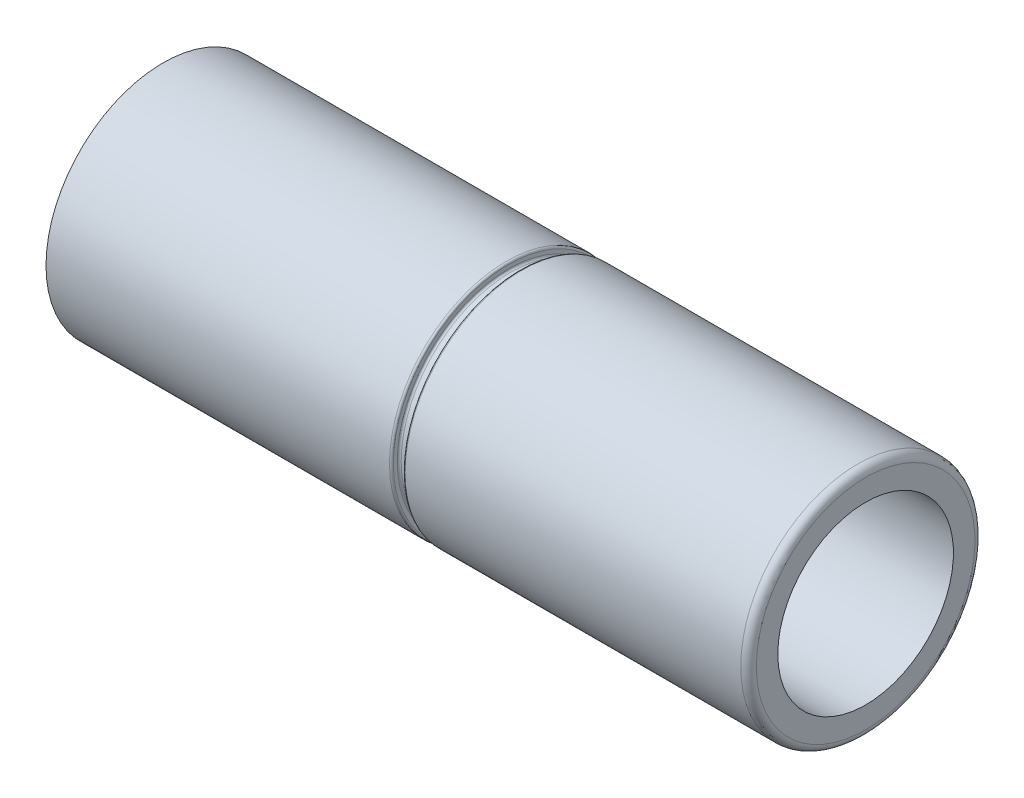
ISO-10303-21;
HEADER;
FILE_DESCRIPTION(('STEP AP214'),'2;1');
FILE_NAME('part.step','',(''),(''),'','','');
FILE_SCHEMA(('AUTOMOTIVE_DESIGN { 1 0 10303 214 1 1 1 1 }'));
ENDSEC;
DATA;
#1=APPLICATION_CONTEXT('core data for automotive mechanical design processes');
#2=APPLICATION_PROTOCOL_DEFINITION('international standard','automotive_design',2000,#1);
#3=PRODUCT_CONTEXT('',#1,'mechanical');
#4=PRODUCT('Part','Part','',(#3));
#5=PRODUCT_RELATED_PRODUCT_CATEGORY('part','',(#4));
#6=PRODUCT_DEFINITION_FORMATION('','',#4);
#7=PRODUCT_DEFINITION_CONTEXT('part definition',#1,'design');
#8=PRODUCT_DEFINITION('design','',#6,#7);
#9=PRODUCT_DEFINITION_SHAPE('','',#8);
#10=(LENGTH_UNIT() NAMED_UNIT(*) SI_UNIT(.MILLI.,.METRE.));
#11=(NAMED_UNIT(*) PLANE_ANGLE_UNIT() SI_UNIT($,.RADIAN.));
#12=(NAMED_UNIT(*) SI_UNIT($,.STERADIAN.) SOLID_ANGLE_UNIT());
#13=UNCERTAINTY_MEASURE_WITH_UNIT(LENGTH_MEASURE(1.E-05),#10,'distance_accuracy_value','');
#14=(GEOMETRIC_REPRESENTATION_CONTEXT(3) GLOBAL_UNCERTAINTY_ASSIGNED_CONTEXT((#13)) GLOBAL_UNIT_ASSIGNED_CONTEXT((#10,
#11,#12)) REPRESENTATION_CONTEXT('',''));
#15=CARTESIAN_POINT('',(0.,0.,0.));
#16=DIRECTION('',(0.,0.,1.));
#17=DIRECTION('',(1.,0.,0.));
#18=AXIS2_PLACEMENT_3D('',#15,#16,#17);
#19=CARTESIAN_POINT('',(0.,0.,0.));
#20=DIRECTION('',(-1.,0.,0.));
#21=DIRECTION('',(0.,0.,1.));
#22=AXIS2_PLACEMENT_3D('',#19,#20,#21);
#23=CYLINDRICAL_SURFACE('',#22,2.25);
#24=CARTESIAN_POINT('',(18.,0.,0.));
#25=DIRECTION('',(-1.,0.,0.));
#26=DIRECTION('',(0.,0.,1.));
#27=AXIS2_PLACEMENT_3D('',#24,#25,#26);
#28=CIRCLE('',#27,2.25);
#29=CARTESIAN_POINT('',(18.,0.,2.25));
#30=VERTEX_POINT('',#29);
#31=EDGE_CURVE('E45',#30,#30,#28,.T.);
#32=ORIENTED_EDGE('',*,*,#31,.F.);
#33=EDGE_LOOP('',(#32));
#34=FACE_BOUND('',#33,.T.);
#35=CARTESIAN_POINT('',(0.,0.,0.));
#36=DIRECTION('',(-1.,0.,0.));
#37=DIRECTION('',(0.,0.,1.));
#38=AXIS2_PLACEMENT_3D('',#35,#36,#37);
#39=CIRCLE('',#38,2.25);
#40=CARTESIAN_POINT('',(0.,0.,2.25));
#41=VERTEX_POINT('',#40);
#42=EDGE_CURVE('E78',#41,#41,#39,.T.);
#43=ORIENTED_EDGE('',*,*,#42,.T.);
#44=EDGE_LOOP('',(#43));
#45=FACE_BOUND('',#44,.T.);
#46=ADVANCED_FACE('F34',(#34,#45),#23,.F.);
#47=CARTESIAN_POINT('',(18.,0.,-2.25));
#48=DIRECTION('',(-1.,0.,0.));
#49=DIRECTION('',(0.,0.,1.));
#50=AXIS2_PLACEMENT_3D('',#47,#48,#49);
#51=PLANE('',#50);
#52=CARTESIAN_POINT('',(18.,0.,0.));
#53=DIRECTION('',(-1.,0.,0.));
#54=DIRECTION('',(0.,0.,1.));
#55=AXIS2_PLACEMENT_3D('',#52,#53,#54);
#56=CIRCLE('',#55,2.8);
#57=CARTESIAN_POINT('',(18.,0.,2.8));
#58=VERTEX_POINT('',#57);
#59=EDGE_CURVE('E10',#58,#58,#56,.F.);
#60=ORIENTED_EDGE('',*,*,#59,.T.);
#61=EDGE_LOOP('',(#60));
#62=FACE_BOUND('',#61,.T.);
#63=ORIENTED_EDGE('',*,*,#31,.T.);
#64=EDGE_LOOP('',(#63));
#65=FACE_BOUND('',#64,.T.);
#66=ADVANCED_FACE('F139',(#62,#65),#51,.F.);
#67=CARTESIAN_POINT('',(0.,0.,0.));
#68=DIRECTION('',(-1.,0.,0.));
#69=DIRECTION('',(0.,0.,1.));
#70=AXIS2_PLACEMENT_3D('',#67,#68,#69);
#71=CYLINDRICAL_SURFACE('',#70,3.);
#72=CARTESIAN_POINT('',(17.8,0.,0.));
#73=DIRECTION('',(-1.,0.,0.));
#74=DIRECTION('',(0.,0.,1.));
#75=AXIS2_PLACEMENT_3D('',#72,#73,#74);
#76=CIRCLE('',#75,3.);
#77=CARTESIAN_POINT('',(17.8,0.,3.));
#78=VERTEX_POINT('',#77);
#79=EDGE_CURVE('E41',#78,#78,#76,.T.);
#80=ORIENTED_EDGE('',*,*,#79,.T.);
#81=EDGE_LOOP('',(#80));
#82=FACE_BOUND('',#81,.T.);
#83=CARTESIAN_POINT('',(9.2,0.,0.));
#84=DIRECTION('',(-1.,0.,0.));
#85=DIRECTION('',(0.,0.,1.));
#86=AXIS2_PLACEMENT_3D('',#83,#84,#85);
#87=CIRCLE('',#86,3.);
#88=CARTESIAN_POINT('',(9.2,0.,3.));
#89=VERTEX_POINT('',#88);
#90=EDGE_CURVE('E49',#89,#89,#87,.T.);
#91=ORIENTED_EDGE('',*,*,#90,.F.);
#92=EDGE_LOOP('',(#91));
#93=FACE_BOUND('',#92,.T.);
#94=ADVANCED_FACE('F134',(#82,#93),#71,.T.);
#95=CARTESIAN_POINT('',(9.2,0.,0.));
#96=DIRECTION('',(-1.,0.,0.));
#97=DIRECTION('',(0.,0.,1.));
#98=AXIS2_PLACEMENT_3D('',#95,#96,#97);
#99=TOROIDAL_SURFACE('',#98,2.95,0.0499999999999997);
#100=CARTESIAN_POINT('',(9.15,0.,0.));
#101=DIRECTION('',(-1.,0.,0.));
#102=DIRECTION('',(0.,0.,1.));
#103=AXIS2_PLACEMENT_3D('',#100,#101,#102);
#104=CIRCLE('',#103,2.95);
#105=CARTESIAN_POINT('',(9.15,0.,2.95));
#106=VERTEX_POINT('',#105);
#107=EDGE_CURVE('E54',#106,#106,#104,.T.);
#108=ORIENTED_EDGE('',*,*,#107,.F.);
#109=EDGE_LOOP('',(#108));
#110=FACE_BOUND('',#109,.T.);
#111=ORIENTED_EDGE('',*,*,#90,.T.);
#112=EDGE_LOOP('',(#111));
#113=FACE_BOUND('',#112,.T.);
#114=ADVANCED_FACE('F128',(#110,#113),#99,.T.);
#115=CARTESIAN_POINT('',(9.15,0.,-2.85));
#116=DIRECTION('',(1.,0.,0.));
#117=DIRECTION('',(0.,0.,-1.));
#118=AXIS2_PLACEMENT_3D('',#115,#116,#117);
#119=PLANE('',#118);
#120=CARTESIAN_POINT('',(9.15,0.,0.));
#121=DIRECTION('',(-1.,0.,0.));
#122=DIRECTION('',(0.,0.,1.));
#123=AXIS2_PLACEMENT_3D('',#120,#121,#122);
#124=CIRCLE('',#123,2.85);
#125=CARTESIAN_POINT('',(9.15,0.,2.85));
#126=VERTEX_POINT('',#125);
#127=EDGE_CURVE('E57',#126,#126,#124,.T.);
#128=ORIENTED_EDGE('',*,*,#127,.F.);
#129=EDGE_LOOP('',(#128));
#130=FACE_BOUND('',#129,.T.);
#131=ORIENTED_EDGE('',*,*,#107,.T.);
#132=EDGE_LOOP('',(#131));
#133=FACE_BOUND('',#132,.T.);
#134=ADVANCED_FACE('F122',(#130,#133),#119,.F.);
#135=CARTESIAN_POINT('',(9.1,0.,0.));
#136=DIRECTION('',(-1.,0.,0.));
#137=DIRECTION('',(0.,0.,1.));
#138=AXIS2_PLACEMENT_3D('',#135,#136,#137);
#139=TOROIDAL_SURFACE('',#138,2.85,0.0499999999999999);
#140=CARTESIAN_POINT('',(9.1,0.,0.));
#141=DIRECTION('',(-1.,0.,0.));
#142=DIRECTION('',(0.,0.,1.));
#143=AXIS2_PLACEMENT_3D('',#140,#141,#142);
#144=CIRCLE('',#143,2.8);
#145=CARTESIAN_POINT('',(9.1,0.,2.8));
#146=VERTEX_POINT('',#145);
#147=EDGE_CURVE('E60',#146,#146,#144,.T.);
#148=ORIENTED_EDGE('',*,*,#147,.F.);
#149=EDGE_LOOP('',(#148));
#150=FACE_BOUND('',#149,.T.);
#151=ORIENTED_EDGE('',*,*,#127,.T.);
#152=EDGE_LOOP('',(#151));
#153=FACE_BOUND('',#152,.T.);
#154=ADVANCED_FACE('F116',(#150,#153),#139,.F.);
#155=CARTESIAN_POINT('',(0.,0.,0.));
#156=DIRECTION('',(-1.,0.,0.));
#157=DIRECTION('',(0.,0.,1.));
#158=AXIS2_PLACEMENT_3D('',#155,#156,#157);
#159=CYLINDRICAL_SURFACE('',#158,2.8);
#160=CARTESIAN_POINT('',(8.9,0.,0.));
#161=DIRECTION('',(-1.,0.,0.));
#162=DIRECTION('',(0.,0.,1.));
#163=AXIS2_PLACEMENT_3D('',#160,#161,#162);
#164=CIRCLE('',#163,2.8);
#165=CARTESIAN_POINT('',(8.9,0.,2.8));
#166=VERTEX_POINT('',#165);
#167=EDGE_CURVE('E63',#166,#166,#164,.T.);
#168=ORIENTED_EDGE('',*,*,#167,.F.);
#169=EDGE_LOOP('',(#168));
#170=FACE_BOUND('',#169,.T.);
#171=ORIENTED_EDGE('',*,*,#147,.T.);
#172=EDGE_LOOP('',(#171));
#173=FACE_BOUND('',#172,.T.);
#174=ADVANCED_FACE('F110',(#170,#173),#159,.T.);
#175=CARTESIAN_POINT('',(8.9,0.,0.));
#176=DIRECTION('',(-1.,0.,0.));
#177=DIRECTION('',(0.,0.,1.));
#178=AXIS2_PLACEMENT_3D('',#175,#176,#177);
#179=TOROIDAL_SURFACE('',#178,2.85,0.0499999999999999);
#180=CARTESIAN_POINT('',(8.85,0.,0.));
#181=DIRECTION('',(-1.,0.,0.));
#182=DIRECTION('',(0.,0.,1.));
#183=AXIS2_PLACEMENT_3D('',#180,#181,#182);
#184=CIRCLE('',#183,2.85);
#185=CARTESIAN_POINT('',(8.85,0.,2.85));
#186=VERTEX_POINT('',#185);
#187=EDGE_CURVE('E66',#186,#186,#184,.T.);
#188=ORIENTED_EDGE('',*,*,#187,.F.);
#189=EDGE_LOOP('',(#188));
#190=FACE_BOUND('',#189,.T.);
#191=ORIENTED_EDGE('',*,*,#167,.T.);
#192=EDGE_LOOP('',(#191));
#193=FACE_BOUND('',#192,.T.);
#194=ADVANCED_FACE('F104',(#190,#193),#179,.F.);
#195=CARTESIAN_POINT('',(8.85,0.,-2.95));
#196=DIRECTION('',(-1.,0.,0.));
#197=DIRECTION('',(0.,0.,1.));
#198=AXIS2_PLACEMENT_3D('',#195,#196,#197);
#199=PLANE('',#198);
#200=CARTESIAN_POINT('',(8.85,0.,0.));
#201=DIRECTION('',(-1.,0.,0.));
#202=DIRECTION('',(0.,0.,1.));
#203=AXIS2_PLACEMENT_3D('',#200,#201,#202);
#204=CIRCLE('',#203,2.95);
#205=CARTESIAN_POINT('',(8.85,0.,2.95));
#206=VERTEX_POINT('',#205);
#207=EDGE_CURVE('E69',#206,#206,#204,.T.);
#208=ORIENTED_EDGE('',*,*,#207,.F.);
#209=EDGE_LOOP('',(#208));
#210=FACE_BOUND('',#209,.T.);
#211=ORIENTED_EDGE('',*,*,#187,.T.);
#212=EDGE_LOOP('',(#211));
#213=FACE_BOUND('',#212,.T.);
#214=ADVANCED_FACE('F98',(#210,#213),#199,.F.);
#215=CARTESIAN_POINT('',(8.8,0.,0.));
#216=DIRECTION('',(-1.,0.,0.));
#217=DIRECTION('',(0.,0.,1.));
#218=AXIS2_PLACEMENT_3D('',#215,#216,#217);
#219=TOROIDAL_SURFACE('',#218,2.95,0.0499999999999997);
#220=CARTESIAN_POINT('',(8.8,0.,0.));
#221=DIRECTION('',(-1.,0.,0.));
#222=DIRECTION('',(0.,0.,1.));
#223=AXIS2_PLACEMENT_3D('',#220,#221,#222);
#224=CIRCLE('',#223,3.);
#225=CARTESIAN_POINT('',(8.8,0.,3.));
#226=VERTEX_POINT('',#225);
#227=EDGE_CURVE('E72',#226,#226,#224,.T.);
#228=ORIENTED_EDGE('',*,*,#227,.F.);
#229=EDGE_LOOP('',(#228));
#230=FACE_BOUND('',#229,.T.);
#231=ORIENTED_EDGE('',*,*,#207,.T.);
#232=EDGE_LOOP('',(#231));
#233=FACE_BOUND('',#232,.T.);
#234=ADVANCED_FACE('F92',(#230,#233),#219,.T.);
#235=CARTESIAN_POINT('',(0.,0.,0.));
#236=DIRECTION('',(-1.,0.,0.));
#237=DIRECTION('',(0.,0.,1.));
#238=AXIS2_PLACEMENT_3D('',#235,#236,#237);
#239=CYLINDRICAL_SURFACE('',#238,3.);
#240=CARTESIAN_POINT('',(0.,0.,0.));
#241=DIRECTION('',(-1.,0.,0.));
#242=DIRECTION('',(0.,0.,1.));
#243=AXIS2_PLACEMENT_3D('',#240,#241,#242);
#244=CIRCLE('',#243,3.);
#245=CARTESIAN_POINT('',(0.,0.,3.));
#246=VERTEX_POINT('',#245);
#247=EDGE_CURVE('E75',#246,#246,#244,.T.);
#248=ORIENTED_EDGE('',*,*,#247,.F.);
#249=EDGE_LOOP('',(#248));
#250=FACE_BOUND('',#249,.T.);
#251=ORIENTED_EDGE('',*,*,#227,.T.);
#252=EDGE_LOOP('',(#251));
#253=FACE_BOUND('',#252,.T.);
#254=ADVANCED_FACE('F86',(#250,#253),#239,.T.);
#255=CARTESIAN_POINT('',(0.,0.,-3.));
#256=DIRECTION('',(1.,0.,0.));
#257=DIRECTION('',(0.,0.,-1.));
#258=AXIS2_PLACEMENT_3D('',#255,#256,#257);
#259=PLANE('',#258);
#260=ORIENTED_EDGE('',*,*,#42,.F.);
#261=EDGE_LOOP('',(#260));
#262=FACE_BOUND('',#261,.T.);
#263=ORIENTED_EDGE('',*,*,#247,.T.);
#264=EDGE_LOOP('',(#263));
#265=FACE_BOUND('',#264,.T.);
#266=ADVANCED_FACE('F83',(#262,#265),#259,.F.);
#267=CARTESIAN_POINT('',(17.8,0.,0.));
#268=DIRECTION('',(-1.,0.,0.));
#269=DIRECTION('',(0.,0.,1.));
#270=AXIS2_PLACEMENT_3D('',#267,#268,#269);
#271=TOROIDAL_SURFACE('',#270,2.8,0.2);
#272=ORIENTED_EDGE('',*,*,#59,.F.);
#273=EDGE_LOOP('',(#272));
#274=FACE_BOUND('',#273,.T.);
#275=ORIENTED_EDGE('',*,*,#79,.F.);
#276=EDGE_LOOP('',(#275));
#277=FACE_BOUND('',#276,.T.);
#278=ADVANCED_FACE('F36',(#274,#277),#271,.T.);
#279=CLOSED_SHELL('',(#46,#66,#94,#114,#134,#154,#174,#194,#214,#234,#254,#266,#278));
#280=MANIFOLD_SOLID_BREP('B2',#279);
#281=ADVANCED_BREP_SHAPE_REPRESENTATION('',(#18,#280),#14);
#282=SHAPE_DEFINITION_REPRESENTATION(#9,#281);
ENDSEC;
END-ISO-10303-21;
